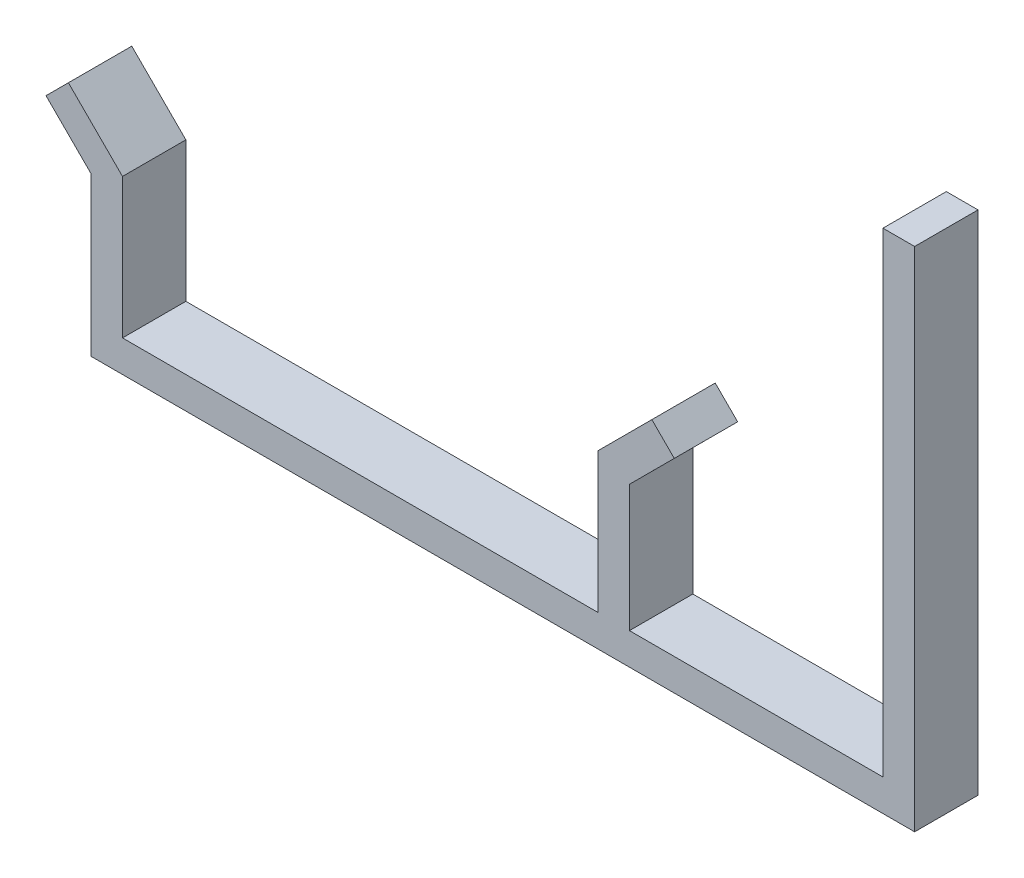
ISO-10303-21;
HEADER;
FILE_DESCRIPTION(('STEP AP214'),'2;1');
FILE_NAME('part.step','',(''),(''),'','','');
FILE_SCHEMA(('AUTOMOTIVE_DESIGN { 1 0 10303 214 1 1 1 1 }'));
ENDSEC;
DATA;
#1=APPLICATION_CONTEXT('core data for automotive mechanical design processes');
#2=APPLICATION_PROTOCOL_DEFINITION('international standard','automotive_design',2000,#1);
#3=PRODUCT_CONTEXT('',#1,'mechanical');
#4=PRODUCT('Part','Part','',(#3));
#5=PRODUCT_RELATED_PRODUCT_CATEGORY('part','',(#4));
#6=PRODUCT_DEFINITION_FORMATION('','',#4);
#7=PRODUCT_DEFINITION_CONTEXT('part definition',#1,'design');
#8=PRODUCT_DEFINITION('design','',#6,#7);
#9=PRODUCT_DEFINITION_SHAPE('','',#8);
#10=(LENGTH_UNIT() NAMED_UNIT(*) SI_UNIT(.MILLI.,.METRE.));
#11=(NAMED_UNIT(*) PLANE_ANGLE_UNIT() SI_UNIT($,.RADIAN.));
#12=(NAMED_UNIT(*) SI_UNIT($,.STERADIAN.) SOLID_ANGLE_UNIT());
#13=UNCERTAINTY_MEASURE_WITH_UNIT(LENGTH_MEASURE(1.E-05),#10,'distance_accuracy_value','');
#14=(GEOMETRIC_REPRESENTATION_CONTEXT(3) GLOBAL_UNCERTAINTY_ASSIGNED_CONTEXT((#13)) GLOBAL_UNIT_ASSIGNED_CONTEXT((#10,
#11,#12)) REPRESENTATION_CONTEXT('',''));
#15=CARTESIAN_POINT('',(0.,0.,0.));
#16=DIRECTION('',(0.,0.,1.));
#17=DIRECTION('',(1.,0.,0.));
#18=AXIS2_PLACEMENT_3D('',#15,#16,#17);
#19=CARTESIAN_POINT('',(-61.4642574773061,-8.0581083784774,10.));
#20=DIRECTION('',(0.707047771974159,0.707165785474932,0.));
#21=DIRECTION('',(-0.707165785474932,0.707047771974159,0.));
#22=AXIS2_PLACEMENT_3D('',#19,#20,#21);
#23=PLANE('',#22);
#24=DIRECTION('',(0.707165785474932,-0.707047771974159,0.));
#25=VECTOR('',#24,1.);
#26=CARTESIAN_POINT('',(-61.4642574773061,-8.0581083784774,0.));
#27=LINE('',#26,#25);
#28=CARTESIAN_POINT('',(-68.5359153320554,-0.987630658735809,0.));
#29=VERTEX_POINT('',#28);
#30=CARTESIAN_POINT('',(-61.4642574773061,-8.0581083784774,0.));
#31=VERTEX_POINT('',#30);
#32=EDGE_CURVE('E180',#29,#31,#27,.T.);
#33=ORIENTED_EDGE('',*,*,#32,.T.);
#34=DIRECTION('',(0.,0.,-1.));
#35=VECTOR('',#34,1.);
#36=CARTESIAN_POINT('',(-61.4642574773061,-8.0581083784774,10.));
#37=LINE('',#36,#35);
#38=CARTESIAN_POINT('',(-61.4642574773061,-8.0581083784774,10.));
#39=VERTEX_POINT('',#38);
#40=EDGE_CURVE('E11',#39,#31,#37,.T.);
#41=ORIENTED_EDGE('',*,*,#40,.F.);
#42=DIRECTION('',(0.707165785474932,-0.707047771974159,0.));
#43=VECTOR('',#42,1.);
#44=CARTESIAN_POINT('',(-61.4642574773061,-8.0581083784774,10.));
#45=LINE('',#44,#43);
#46=CARTESIAN_POINT('',(-68.5359153320554,-0.987630658735809,10.));
#47=VERTEX_POINT('',#46);
#48=EDGE_CURVE('E210',#47,#39,#45,.T.);
#49=ORIENTED_EDGE('',*,*,#48,.F.);
#50=DIRECTION('',(0.,0.,-1.));
#51=VECTOR('',#50,1.);
#52=CARTESIAN_POINT('',(-68.5359153320554,-0.987630658735809,10.));
#53=LINE('',#52,#51);
#54=EDGE_CURVE('E176',#47,#29,#53,.T.);
#55=ORIENTED_EDGE('',*,*,#54,.T.);
#56=EDGE_LOOP('',(#33,#41,#49,#55));
#57=FACE_BOUND('',#56,.T.);
#58=ADVANCED_FACE('F36',(#57),#23,.F.);
#59=CARTESIAN_POINT('',(-61.4642574773061,-8.0581083784774,10.));
#60=DIRECTION('',(1.,0.,0.));
#61=DIRECTION('',(0.,0.,-1.));
#62=AXIS2_PLACEMENT_3D('',#59,#60,#61);
#63=PLANE('',#62);
#64=DIRECTION('',(0.,-1.,0.));
#65=VECTOR('',#64,1.);
#66=CARTESIAN_POINT('',(-61.4642574773061,-8.0581083784774,0.));
#67=LINE('',#66,#65);
#68=CARTESIAN_POINT('',(-61.4642574773061,-33.0581083784774,0.));
#69=VERTEX_POINT('',#68);
#70=EDGE_CURVE('E183',#31,#69,#67,.T.);
#71=ORIENTED_EDGE('',*,*,#70,.T.);
#72=DIRECTION('',(0.,0.,-1.));
#73=VECTOR('',#72,1.);
#74=CARTESIAN_POINT('',(-61.4642574773061,-33.0581083784774,10.));
#75=LINE('',#74,#73);
#76=CARTESIAN_POINT('',(-61.4642574773061,-33.0581083784774,10.));
#77=VERTEX_POINT('',#76);
#78=EDGE_CURVE('E44',#77,#69,#75,.T.);
#79=ORIENTED_EDGE('',*,*,#78,.F.);
#80=DIRECTION('',(0.,-1.,0.));
#81=VECTOR('',#80,1.);
#82=CARTESIAN_POINT('',(-61.4642574773061,-8.0581083784774,10.));
#83=LINE('',#82,#81);
#84=EDGE_CURVE('E119',#39,#77,#83,.T.);
#85=ORIENTED_EDGE('',*,*,#84,.F.);
#86=ORIENTED_EDGE('',*,*,#40,.T.);
#87=EDGE_LOOP('',(#71,#79,#85,#86));
#88=FACE_BOUND('',#87,.T.);
#89=ADVANCED_FACE('F308',(#88),#63,.F.);
#90=CARTESIAN_POINT('',(-61.4642574773061,-33.0581083784774,10.));
#91=DIRECTION('',(0.,1.,0.));
#92=DIRECTION('',(0.,0.,1.));
#93=AXIS2_PLACEMENT_3D('',#90,#91,#92);
#94=PLANE('',#93);
#95=DIRECTION('',(1.,0.,0.));
#96=VECTOR('',#95,1.);
#97=CARTESIAN_POINT('',(-61.4642574773061,-33.0581083784774,0.));
#98=LINE('',#97,#96);
#99=CARTESIAN_POINT('',(68.5359153320554,-33.0581083784774,0.));
#100=VERTEX_POINT('',#99);
#101=EDGE_CURVE('E185',#69,#100,#98,.T.);
#102=ORIENTED_EDGE('',*,*,#101,.T.);
#103=DIRECTION('',(0.,0.,-1.));
#104=VECTOR('',#103,1.);
#105=CARTESIAN_POINT('',(68.5359153320554,-33.0581083784774,10.));
#106=LINE('',#105,#104);
#107=CARTESIAN_POINT('',(68.5359153320554,-33.0581083784774,10.));
#108=VERTEX_POINT('',#107);
#109=EDGE_CURVE('E241',#108,#100,#106,.T.);
#110=ORIENTED_EDGE('',*,*,#109,.F.);
#111=DIRECTION('',(1.,0.,0.));
#112=VECTOR('',#111,1.);
#113=CARTESIAN_POINT('',(-61.4642574773061,-33.0581083784774,10.));
#114=LINE('',#113,#112);
#115=EDGE_CURVE('E249',#77,#108,#114,.T.);
#116=ORIENTED_EDGE('',*,*,#115,.F.);
#117=ORIENTED_EDGE('',*,*,#78,.T.);
#118=EDGE_LOOP('',(#102,#110,#116,#117));
#119=FACE_BOUND('',#118,.T.);
#120=ADVANCED_FACE('F247',(#119),#94,.F.);
#121=CARTESIAN_POINT('',(68.5359153320554,-33.0581083784774,10.));
#122=DIRECTION('',(-1.,0.,0.));
#123=DIRECTION('',(0.,-1.,0.));
#124=AXIS2_PLACEMENT_3D('',#121,#122,#123);
#125=PLANE('',#124);
#126=DIRECTION('',(0.,1.,0.));
#127=VECTOR('',#126,1.);
#128=CARTESIAN_POINT('',(68.5359153320554,-33.0581083784774,0.));
#129=LINE('',#128,#127);
#130=CARTESIAN_POINT('',(68.5359153320554,46.9418916215226,0.));
#131=VERTEX_POINT('',#130);
#132=EDGE_CURVE('E187',#100,#131,#129,.T.);
#133=ORIENTED_EDGE('',*,*,#132,.T.);
#134=DIRECTION('',(0.,0.,-1.));
#135=VECTOR('',#134,1.);
#136=CARTESIAN_POINT('',(68.5359153320554,46.9418916215226,10.));
#137=LINE('',#136,#135);
#138=CARTESIAN_POINT('',(68.5359153320554,46.9418916215226,10.));
#139=VERTEX_POINT('',#138);
#140=EDGE_CURVE('E238',#139,#131,#137,.T.);
#141=ORIENTED_EDGE('',*,*,#140,.F.);
#142=DIRECTION('',(0.,1.,0.));
#143=VECTOR('',#142,1.);
#144=CARTESIAN_POINT('',(68.5359153320554,-33.0581083784774,10.));
#145=LINE('',#144,#143);
#146=EDGE_CURVE('E267',#108,#139,#145,.T.);
#147=ORIENTED_EDGE('',*,*,#146,.F.);
#148=ORIENTED_EDGE('',*,*,#109,.T.);
#149=EDGE_LOOP('',(#133,#141,#147,#148));
#150=FACE_BOUND('',#149,.T.);
#151=ADVANCED_FACE('F258',(#150),#125,.F.);
#152=CARTESIAN_POINT('',(63.5359153320554,46.9418916215226,10.));
#153=DIRECTION('',(0.,-1.,0.));
#154=DIRECTION('',(1.,0.,0.));
#155=AXIS2_PLACEMENT_3D('',#152,#153,#154);
#156=PLANE('',#155);
#157=DIRECTION('',(-1.,0.,0.));
#158=VECTOR('',#157,1.);
#159=CARTESIAN_POINT('',(63.5359153320554,46.9418916215226,0.));
#160=LINE('',#159,#158);
#161=CARTESIAN_POINT('',(63.5359153320554,46.9418916215226,0.));
#162=VERTEX_POINT('',#161);
#163=EDGE_CURVE('E189',#131,#162,#160,.T.);
#164=ORIENTED_EDGE('',*,*,#163,.T.);
#165=DIRECTION('',(0.,0.,-1.));
#166=VECTOR('',#165,1.);
#167=CARTESIAN_POINT('',(63.5359153320554,46.9418916215226,10.));
#168=LINE('',#167,#166);
#169=CARTESIAN_POINT('',(63.5359153320554,46.9418916215226,10.));
#170=VERTEX_POINT('',#169);
#171=EDGE_CURVE('E235',#170,#162,#168,.T.);
#172=ORIENTED_EDGE('',*,*,#171,.F.);
#173=DIRECTION('',(-1.,0.,0.));
#174=VECTOR('',#173,1.);
#175=CARTESIAN_POINT('',(63.5359153320554,46.9418916215226,10.));
#176=LINE('',#175,#174);
#177=EDGE_CURVE('E264',#139,#170,#176,.T.);
#178=ORIENTED_EDGE('',*,*,#177,.F.);
#179=ORIENTED_EDGE('',*,*,#140,.T.);
#180=EDGE_LOOP('',(#164,#172,#178,#179));
#181=FACE_BOUND('',#180,.T.);
#182=ADVANCED_FACE('F262',(#181),#156,.F.);
#183=CARTESIAN_POINT('',(63.5359153320554,-28.0581083784774,10.));
#184=DIRECTION('',(1.,0.,0.));
#185=DIRECTION('',(0.,1.,0.));
#186=AXIS2_PLACEMENT_3D('',#183,#184,#185);
#187=PLANE('',#186);
#188=DIRECTION('',(0.,-1.,0.));
#189=VECTOR('',#188,1.);
#190=CARTESIAN_POINT('',(63.5359153320554,-28.0581083784774,0.));
#191=LINE('',#190,#189);
#192=CARTESIAN_POINT('',(63.5359153320554,-28.0581083784774,0.));
#193=VERTEX_POINT('',#192);
#194=EDGE_CURVE('E191',#162,#193,#191,.T.);
#195=ORIENTED_EDGE('',*,*,#194,.T.);
#196=DIRECTION('',(0.,0.,-1.));
#197=VECTOR('',#196,1.);
#198=CARTESIAN_POINT('',(63.5359153320554,-28.0581083784774,10.));
#199=LINE('',#198,#197);
#200=CARTESIAN_POINT('',(63.5359153320554,-28.0581083784774,10.));
#201=VERTEX_POINT('',#200);
#202=EDGE_CURVE('E232',#201,#193,#199,.T.);
#203=ORIENTED_EDGE('',*,*,#202,.F.);
#204=DIRECTION('',(0.,-1.,0.));
#205=VECTOR('',#204,1.);
#206=CARTESIAN_POINT('',(63.5359153320554,-28.0581083784774,10.));
#207=LINE('',#206,#205);
#208=EDGE_CURVE('E266',#170,#201,#207,.T.);
#209=ORIENTED_EDGE('',*,*,#208,.F.);
#210=ORIENTED_EDGE('',*,*,#171,.T.);
#211=EDGE_LOOP('',(#195,#203,#209,#210));
#212=FACE_BOUND('',#211,.T.);
#213=ADVANCED_FACE('F321',(#212),#187,.F.);
#214=CARTESIAN_POINT('',(63.5359153320554,-28.0581083784774,10.));
#215=DIRECTION('',(0.,-1.,0.));
#216=DIRECTION('',(1.,0.,0.));
#217=AXIS2_PLACEMENT_3D('',#214,#215,#216);
#218=PLANE('',#217);
#219=DIRECTION('',(-1.,0.,0.));
#220=VECTOR('',#219,1.);
#221=CARTESIAN_POINT('',(63.5359153320554,-28.0581083784774,0.));
#222=LINE('',#221,#220);
#223=CARTESIAN_POINT('',(23.5359153320554,-28.0581083784774,0.));
#224=VERTEX_POINT('',#223);
#225=EDGE_CURVE('E193',#193,#224,#222,.T.);
#226=ORIENTED_EDGE('',*,*,#225,.T.);
#227=DIRECTION('',(0.,0.,-1.));
#228=VECTOR('',#227,1.);
#229=CARTESIAN_POINT('',(23.5359153320554,-28.0581083784774,10.));
#230=LINE('',#229,#228);
#231=CARTESIAN_POINT('',(23.5359153320554,-28.0581083784774,10.));
#232=VERTEX_POINT('',#231);
#233=EDGE_CURVE('E229',#232,#224,#230,.T.);
#234=ORIENTED_EDGE('',*,*,#233,.F.);
#235=DIRECTION('',(-1.,0.,0.));
#236=VECTOR('',#235,1.);
#237=CARTESIAN_POINT('',(63.5359153320554,-28.0581083784774,10.));
#238=LINE('',#237,#236);
#239=EDGE_CURVE('E269',#201,#232,#238,.T.);
#240=ORIENTED_EDGE('',*,*,#239,.F.);
#241=ORIENTED_EDGE('',*,*,#202,.T.);
#242=EDGE_LOOP('',(#226,#234,#240,#241));
#243=FACE_BOUND('',#242,.T.);
#244=ADVANCED_FACE('F324',(#243),#218,.F.);
#245=CARTESIAN_POINT('',(23.5359153320554,-28.0581083784774,10.));
#246=DIRECTION('',(-1.,0.,0.));
#247=DIRECTION('',(0.,-1.,0.));
#248=AXIS2_PLACEMENT_3D('',#245,#246,#247);
#249=PLANE('',#248);
#250=DIRECTION('',(0.,1.,0.));
#251=VECTOR('',#250,1.);
#252=CARTESIAN_POINT('',(23.5359153320554,-28.0581083784774,0.));
#253=LINE('',#252,#251);
#254=CARTESIAN_POINT('',(23.5359153320554,-8.05810837847742,0.));
#255=VERTEX_POINT('',#254);
#256=EDGE_CURVE('E195',#224,#255,#253,.T.);
#257=ORIENTED_EDGE('',*,*,#256,.T.);
#258=DIRECTION('',(0.,0.,-1.));
#259=VECTOR('',#258,1.);
#260=CARTESIAN_POINT('',(23.5359153320554,-8.05810837847742,10.));
#261=LINE('',#260,#259);
#262=CARTESIAN_POINT('',(23.5359153320554,-8.05810837847742,10.));
#263=VERTEX_POINT('',#262);
#264=EDGE_CURVE('E226',#263,#255,#261,.T.);
#265=ORIENTED_EDGE('',*,*,#264,.F.);
#266=DIRECTION('',(0.,1.,0.));
#267=VECTOR('',#266,1.);
#268=CARTESIAN_POINT('',(23.5359153320554,-28.0581083784774,10.));
#269=LINE('',#268,#267);
#270=EDGE_CURVE('E275',#232,#263,#269,.T.);
#271=ORIENTED_EDGE('',*,*,#270,.F.);
#272=ORIENTED_EDGE('',*,*,#233,.T.);
#273=EDGE_LOOP('',(#257,#265,#271,#272));
#274=FACE_BOUND('',#273,.T.);
#275=ADVANCED_FACE('F328',(#274),#249,.F.);
#276=CARTESIAN_POINT('',(23.5359153320554,-8.05810837847742,10.));
#277=DIRECTION('',(-0.707165785474931,0.70704777197416,0.));
#278=DIRECTION('',(-0.70704777197416,-0.707165785474931,0.));
#279=AXIS2_PLACEMENT_3D('',#276,#277,#278);
#280=PLANE('',#279);
#281=DIRECTION('',(0.70704777197416,0.707165785474931,0.));
#282=VECTOR('',#281,1.);
#283=CARTESIAN_POINT('',(23.5359153320554,-8.05810837847742,0.));
#284=LINE('',#283,#282);
#285=CARTESIAN_POINT('',(30.606393051797,-0.986450523728092,0.));
#286=VERTEX_POINT('',#285);
#287=EDGE_CURVE('E197',#255,#286,#284,.T.);
#288=ORIENTED_EDGE('',*,*,#287,.T.);
#289=DIRECTION('',(0.,0.,-1.));
#290=VECTOR('',#289,1.);
#291=CARTESIAN_POINT('',(30.606393051797,-0.986450523728092,10.));
#292=LINE('',#291,#290);
#293=CARTESIAN_POINT('',(30.606393051797,-0.986450523728092,10.));
#294=VERTEX_POINT('',#293);
#295=EDGE_CURVE('E223',#294,#286,#292,.T.);
#296=ORIENTED_EDGE('',*,*,#295,.F.);
#297=DIRECTION('',(0.70704777197416,0.707165785474931,0.));
#298=VECTOR('',#297,1.);
#299=CARTESIAN_POINT('',(23.5359153320554,-8.05810837847742,10.));
#300=LINE('',#299,#298);
#301=EDGE_CURVE('E277',#263,#294,#300,.T.);
#302=ORIENTED_EDGE('',*,*,#301,.F.);
#303=ORIENTED_EDGE('',*,*,#264,.T.);
#304=EDGE_LOOP('',(#288,#296,#302,#303));
#305=FACE_BOUND('',#304,.T.);
#306=ADVANCED_FACE('F332',(#305),#280,.F.);
#307=CARTESIAN_POINT('',(30.606393051797,-0.986450523728092,10.));
#308=DIRECTION('',(-0.70704777197416,-0.707165785474931,0.));
#309=DIRECTION('',(0.707165785474931,-0.70704777197416,0.));
#310=AXIS2_PLACEMENT_3D('',#307,#308,#309);
#311=PLANE('',#310);
#312=DIRECTION('',(-0.707165785474931,0.70704777197416,0.));
#313=VECTOR('',#312,1.);
#314=CARTESIAN_POINT('',(30.606393051797,-0.986450523728092,0.));
#315=LINE('',#314,#313);
#316=CARTESIAN_POINT('',(27.0705641244224,2.54878833614271,0.));
#317=VERTEX_POINT('',#316);
#318=EDGE_CURVE('E199',#286,#317,#315,.T.);
#319=ORIENTED_EDGE('',*,*,#318,.T.);
#320=DIRECTION('',(0.,0.,-1.));
#321=VECTOR('',#320,1.);
#322=CARTESIAN_POINT('',(27.0705641244224,2.54878833614271,10.));
#323=LINE('',#322,#321);
#324=CARTESIAN_POINT('',(27.0705641244224,2.54878833614271,10.));
#325=VERTEX_POINT('',#324);
#326=EDGE_CURVE('E220',#325,#317,#323,.T.);
#327=ORIENTED_EDGE('',*,*,#326,.F.);
#328=DIRECTION('',(-0.707165785474931,0.70704777197416,0.));
#329=VECTOR('',#328,1.);
#330=CARTESIAN_POINT('',(30.606393051797,-0.986450523728092,10.));
#331=LINE('',#330,#329);
#332=EDGE_CURVE('E279',#294,#325,#331,.T.);
#333=ORIENTED_EDGE('',*,*,#332,.F.);
#334=ORIENTED_EDGE('',*,*,#295,.T.);
#335=EDGE_LOOP('',(#319,#327,#333,#334));
#336=FACE_BOUND('',#335,.T.);
#337=ADVANCED_FACE('F336',(#336),#311,.F.);
#338=CARTESIAN_POINT('',(18.5357425226939,-5.9874578145563,10.));
#339=DIRECTION('',(0.707165785474931,-0.70704777197416,0.));
#340=DIRECTION('',(0.70704777197416,0.707165785474931,0.));
#341=AXIS2_PLACEMENT_3D('',#338,#339,#340);
#342=PLANE('',#341);
#343=DIRECTION('',(-0.70704777197416,-0.707165785474931,0.));
#344=VECTOR('',#343,1.);
#345=CARTESIAN_POINT('',(18.5357425226939,-5.9874578145563,0.));
#346=LINE('',#345,#344);
#347=CARTESIAN_POINT('',(18.5357425226939,-5.9874578145563,0.));
#348=VERTEX_POINT('',#347);
#349=EDGE_CURVE('E201',#317,#348,#346,.T.);
#350=ORIENTED_EDGE('',*,*,#349,.T.);
#351=DIRECTION('',(0.,0.,-1.));
#352=VECTOR('',#351,1.);
#353=CARTESIAN_POINT('',(18.5357425226939,-5.9874578145563,10.));
#354=LINE('',#353,#352);
#355=CARTESIAN_POINT('',(18.5357425226939,-5.9874578145563,10.));
#356=VERTEX_POINT('',#355);
#357=EDGE_CURVE('E217',#356,#348,#354,.T.);
#358=ORIENTED_EDGE('',*,*,#357,.F.);
#359=DIRECTION('',(-0.70704777197416,-0.707165785474931,0.));
#360=VECTOR('',#359,1.);
#361=CARTESIAN_POINT('',(18.5357425226939,-5.9874578145563,10.));
#362=LINE('',#361,#360);
#363=EDGE_CURVE('E281',#325,#356,#362,.T.);
#364=ORIENTED_EDGE('',*,*,#363,.F.);
#365=ORIENTED_EDGE('',*,*,#326,.T.);
#366=EDGE_LOOP('',(#350,#358,#364,#365));
#367=FACE_BOUND('',#366,.T.);
#368=ADVANCED_FACE('F340',(#367),#342,.F.);
#369=CARTESIAN_POINT('',(18.5357425226939,-28.0581083784774,10.));
#370=DIRECTION('',(1.,0.,0.));
#371=DIRECTION('',(0.,0.,-1.));
#372=AXIS2_PLACEMENT_3D('',#369,#370,#371);
#373=PLANE('',#372);
#374=DIRECTION('',(0.,-1.,0.));
#375=VECTOR('',#374,1.);
#376=CARTESIAN_POINT('',(18.5357425226939,-28.0581083784774,0.));
#377=LINE('',#376,#375);
#378=CARTESIAN_POINT('',(18.5357425226939,-28.0581083784774,0.));
#379=VERTEX_POINT('',#378);
#380=EDGE_CURVE('E203',#348,#379,#377,.T.);
#381=ORIENTED_EDGE('',*,*,#380,.T.);
#382=DIRECTION('',(0.,0.,-1.));
#383=VECTOR('',#382,1.);
#384=CARTESIAN_POINT('',(18.5357425226939,-28.0581083784774,10.));
#385=LINE('',#384,#383);
#386=CARTESIAN_POINT('',(18.5357425226939,-28.0581083784774,10.));
#387=VERTEX_POINT('',#386);
#388=EDGE_CURVE('E214',#387,#379,#385,.T.);
#389=ORIENTED_EDGE('',*,*,#388,.F.);
#390=DIRECTION('',(0.,-1.,0.));
#391=VECTOR('',#390,1.);
#392=CARTESIAN_POINT('',(18.5357425226939,-28.0581083784774,10.));
#393=LINE('',#392,#391);
#394=EDGE_CURVE('E283',#356,#387,#393,.T.);
#395=ORIENTED_EDGE('',*,*,#394,.F.);
#396=ORIENTED_EDGE('',*,*,#357,.T.);
#397=EDGE_LOOP('',(#381,#389,#395,#396));
#398=FACE_BOUND('',#397,.T.);
#399=ADVANCED_FACE('F289',(#398),#373,.F.);
#400=CARTESIAN_POINT('',(18.5357425226939,-28.0581083784774,10.));
#401=DIRECTION('',(0.,-1.,0.));
#402=DIRECTION('',(1.,0.,0.));
#403=AXIS2_PLACEMENT_3D('',#400,#401,#402);
#404=PLANE('',#403);
#405=DIRECTION('',(-1.,0.,0.));
#406=VECTOR('',#405,1.);
#407=CARTESIAN_POINT('',(18.5357425226939,-28.0581083784774,0.));
#408=LINE('',#407,#406);
#409=CARTESIAN_POINT('',(-56.4642574773061,-28.0581083784774,0.));
#410=VERTEX_POINT('',#409);
#411=EDGE_CURVE('E205',#379,#410,#408,.T.);
#412=ORIENTED_EDGE('',*,*,#411,.T.);
#413=DIRECTION('',(0.,0.,-1.));
#414=VECTOR('',#413,1.);
#415=CARTESIAN_POINT('',(-56.4642574773061,-28.0581083784774,10.));
#416=LINE('',#415,#414);
#417=CARTESIAN_POINT('',(-56.4642574773061,-28.0581083784774,10.));
#418=VERTEX_POINT('',#417);
#419=EDGE_CURVE('E171',#418,#410,#416,.T.);
#420=ORIENTED_EDGE('',*,*,#419,.F.);
#421=DIRECTION('',(-1.,0.,0.));
#422=VECTOR('',#421,1.);
#423=CARTESIAN_POINT('',(18.5357425226939,-28.0581083784774,10.));
#424=LINE('',#423,#422);
#425=EDGE_CURVE('E162',#387,#418,#424,.T.);
#426=ORIENTED_EDGE('',*,*,#425,.F.);
#427=ORIENTED_EDGE('',*,*,#388,.T.);
#428=EDGE_LOOP('',(#412,#420,#426,#427));
#429=FACE_BOUND('',#428,.T.);
#430=ADVANCED_FACE('F293',(#429),#404,.F.);
#431=CARTESIAN_POINT('',(-56.4642574773061,-28.0581083784774,10.));
#432=DIRECTION('',(-1.,0.,0.));
#433=DIRECTION('',(0.,0.,1.));
#434=AXIS2_PLACEMENT_3D('',#431,#432,#433);
#435=PLANE('',#434);
#436=DIRECTION('',(0.,1.,0.));
#437=VECTOR('',#436,1.);
#438=CARTESIAN_POINT('',(-56.4642574773061,-28.0581083784774,0.));
#439=LINE('',#438,#437);
#440=CARTESIAN_POINT('',(-56.4642574773061,-5.98704056661191,0.));
#441=VERTEX_POINT('',#440);
#442=EDGE_CURVE('E170',#410,#441,#439,.T.);
#443=ORIENTED_EDGE('',*,*,#442,.T.);
#444=DIRECTION('',(0.,0.,-1.));
#445=VECTOR('',#444,1.);
#446=CARTESIAN_POINT('',(-56.4642574773061,-5.98704056661191,10.));
#447=LINE('',#446,#445);
#448=CARTESIAN_POINT('',(-56.4642574773061,-5.98704056661191,10.));
#449=VERTEX_POINT('',#448);
#450=EDGE_CURVE('E167',#449,#441,#447,.T.);
#451=ORIENTED_EDGE('',*,*,#450,.F.);
#452=DIRECTION('',(0.,1.,0.));
#453=VECTOR('',#452,1.);
#454=CARTESIAN_POINT('',(-56.4642574773061,-28.0581083784774,10.));
#455=LINE('',#454,#453);
#456=EDGE_CURVE('E156',#418,#449,#455,.T.);
#457=ORIENTED_EDGE('',*,*,#456,.F.);
#458=ORIENTED_EDGE('',*,*,#419,.T.);
#459=EDGE_LOOP('',(#443,#451,#457,#458));
#460=FACE_BOUND('',#459,.T.);
#461=ADVANCED_FACE('F168',(#460),#435,.F.);
#462=CARTESIAN_POINT('',(-56.4642574773061,-5.98704056661191,10.));
#463=DIRECTION('',(-0.707057896003834,-0.707155662989862,0.));
#464=DIRECTION('',(0.707155662989862,-0.707057896003834,0.));
#465=AXIS2_PLACEMENT_3D('',#462,#463,#464);
#466=PLANE('',#465);
#467=DIRECTION('',(-0.707155662989862,0.707057896003834,0.));
#468=VECTOR('',#467,1.);
#469=CARTESIAN_POINT('',(-56.4642574773061,-5.98704056661191,0.));
#470=LINE('',#469,#468);
#471=CARTESIAN_POINT('',(-65.0009716167513,2.54849333932081,0.));
#472=VERTEX_POINT('',#471);
#473=EDGE_CURVE('E105',#441,#472,#470,.T.);
#474=ORIENTED_EDGE('',*,*,#473,.T.);
#475=DIRECTION('',(0.,0.,-1.));
#476=VECTOR('',#475,1.);
#477=CARTESIAN_POINT('',(-65.0009716167513,2.54849333932081,10.));
#478=LINE('',#477,#476);
#479=CARTESIAN_POINT('',(-65.0009716167513,2.54849333932081,10.));
#480=VERTEX_POINT('',#479);
#481=EDGE_CURVE('E172',#480,#472,#478,.T.);
#482=ORIENTED_EDGE('',*,*,#481,.F.);
#483=DIRECTION('',(-0.707155662989862,0.707057896003834,0.));
#484=VECTOR('',#483,1.);
#485=CARTESIAN_POINT('',(-56.4642574773061,-5.98704056661191,10.));
#486=LINE('',#485,#484);
#487=EDGE_CURVE('E160',#449,#480,#486,.T.);
#488=ORIENTED_EDGE('',*,*,#487,.F.);
#489=ORIENTED_EDGE('',*,*,#450,.T.);
#490=EDGE_LOOP('',(#474,#482,#488,#489));
#491=FACE_BOUND('',#490,.T.);
#492=ADVANCED_FACE('F174',(#491),#466,.F.);
#493=CARTESIAN_POINT('',(-68.5359153320554,-0.987630658735809,10.));
#494=DIRECTION('',(0.707224799611322,-0.706988743060825,0.));
#495=DIRECTION('',(0.706988743060825,0.707224799611322,0.));
#496=AXIS2_PLACEMENT_3D('',#493,#494,#495);
#497=PLANE('',#496);
#498=DIRECTION('',(-0.706988743060825,-0.707224799611322,0.));
#499=VECTOR('',#498,1.);
#500=CARTESIAN_POINT('',(-68.5359153320554,-0.987630658735809,0.));
#501=LINE('',#500,#499);
#502=EDGE_CURVE('E111',#472,#29,#501,.T.);
#503=ORIENTED_EDGE('',*,*,#502,.T.);
#504=ORIENTED_EDGE('',*,*,#54,.F.);
#505=DIRECTION('',(-0.706988743060825,-0.707224799611322,0.));
#506=VECTOR('',#505,1.);
#507=CARTESIAN_POINT('',(-68.5359153320554,-0.987630658735809,10.));
#508=LINE('',#507,#506);
#509=EDGE_CURVE('E52',#480,#47,#508,.T.);
#510=ORIENTED_EDGE('',*,*,#509,.F.);
#511=ORIENTED_EDGE('',*,*,#481,.T.);
#512=EDGE_LOOP('',(#503,#504,#510,#511));
#513=FACE_BOUND('',#512,.T.);
#514=ADVANCED_FACE('F297',(#513),#497,.F.);
#515=CARTESIAN_POINT('',(0.,0.,10.));
#516=DIRECTION('',(0.,0.,-1.));
#517=DIRECTION('',(-1.,0.,0.));
#518=AXIS2_PLACEMENT_3D('',#515,#516,#517);
#519=PLANE('',#518);
#520=ORIENTED_EDGE('',*,*,#48,.T.);
#521=ORIENTED_EDGE('',*,*,#84,.T.);
#522=ORIENTED_EDGE('',*,*,#115,.T.);
#523=ORIENTED_EDGE('',*,*,#146,.T.);
#524=ORIENTED_EDGE('',*,*,#177,.T.);
#525=ORIENTED_EDGE('',*,*,#208,.T.);
#526=ORIENTED_EDGE('',*,*,#239,.T.);
#527=ORIENTED_EDGE('',*,*,#270,.T.);
#528=ORIENTED_EDGE('',*,*,#301,.T.);
#529=ORIENTED_EDGE('',*,*,#332,.T.);
#530=ORIENTED_EDGE('',*,*,#363,.T.);
#531=ORIENTED_EDGE('',*,*,#394,.T.);
#532=ORIENTED_EDGE('',*,*,#425,.T.);
#533=ORIENTED_EDGE('',*,*,#456,.T.);
#534=ORIENTED_EDGE('',*,*,#487,.T.);
#535=ORIENTED_EDGE('',*,*,#509,.T.);
#536=EDGE_LOOP('',(#520,#521,#522,#523,#524,#525,#526,#527,#528,#529,#530,#531,#532,#533,#534,#535));
#537=FACE_BOUND('',#536,.T.);
#538=ADVANCED_FACE('F158',(#537),#519,.F.);
#539=CARTESIAN_POINT('',(0.,0.,0.));
#540=DIRECTION('',(0.,0.,-1.));
#541=DIRECTION('',(-1.,0.,0.));
#542=AXIS2_PLACEMENT_3D('',#539,#540,#541);
#543=PLANE('',#542);
#544=ORIENTED_EDGE('',*,*,#32,.F.);
#545=ORIENTED_EDGE('',*,*,#502,.F.);
#546=ORIENTED_EDGE('',*,*,#473,.F.);
#547=ORIENTED_EDGE('',*,*,#442,.F.);
#548=ORIENTED_EDGE('',*,*,#411,.F.);
#549=ORIENTED_EDGE('',*,*,#380,.F.);
#550=ORIENTED_EDGE('',*,*,#349,.F.);
#551=ORIENTED_EDGE('',*,*,#318,.F.);
#552=ORIENTED_EDGE('',*,*,#287,.F.);
#553=ORIENTED_EDGE('',*,*,#256,.F.);
#554=ORIENTED_EDGE('',*,*,#225,.F.);
#555=ORIENTED_EDGE('',*,*,#194,.F.);
#556=ORIENTED_EDGE('',*,*,#163,.F.);
#557=ORIENTED_EDGE('',*,*,#132,.F.);
#558=ORIENTED_EDGE('',*,*,#101,.F.);
#559=ORIENTED_EDGE('',*,*,#70,.F.);
#560=EDGE_LOOP('',(#544,#545,#546,#547,#548,#549,#550,#551,#552,#553,#554,#555,#556,#557,#558,#559));
#561=FACE_BOUND('',#560,.T.);
#562=ADVANCED_FACE('F253',(#561),#543,.T.);
#563=CLOSED_SHELL('',(#58,#89,#120,#151,#182,#213,#244,#275,#306,#337,#368,#399,#430,#461,#492,
#514,#538,#562));
#564=MANIFOLD_SOLID_BREP('B2',#563);
#565=ADVANCED_BREP_SHAPE_REPRESENTATION('',(#18,#564),#14);
#566=SHAPE_DEFINITION_REPRESENTATION(#9,#565);
ENDSEC;
END-ISO-10303-21;
